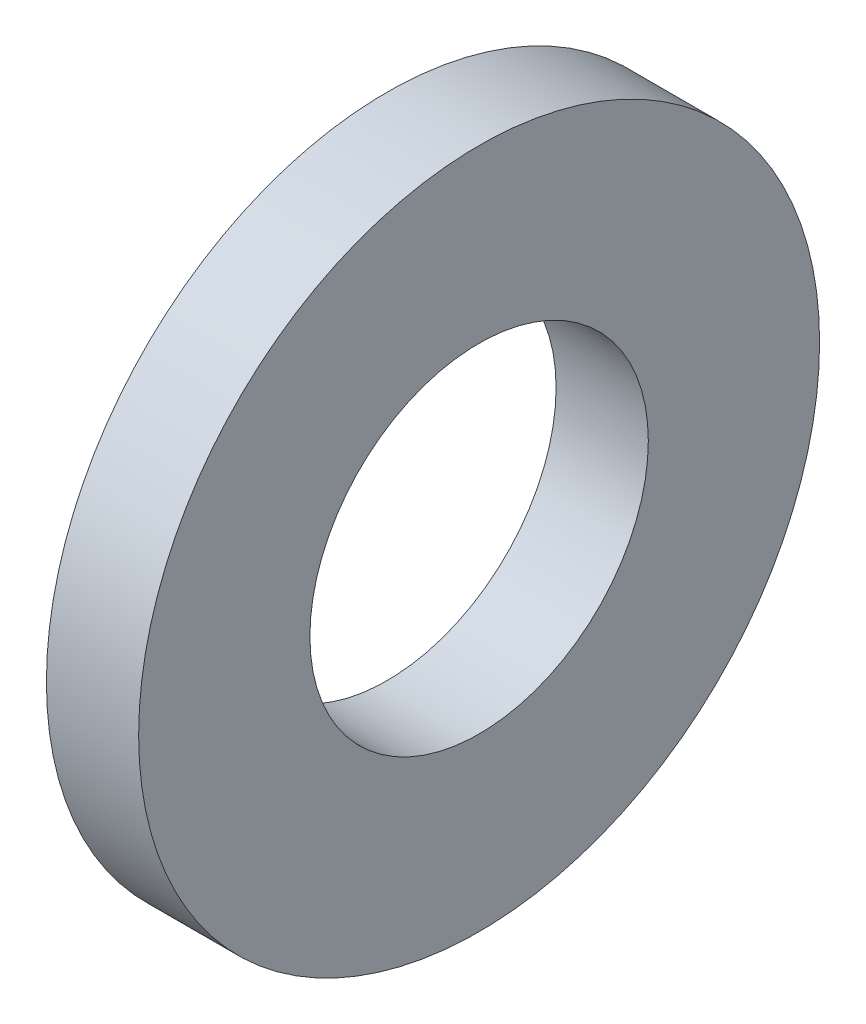
ISO-10303-21;
HEADER;
FILE_DESCRIPTION(('STEP AP214'),'2;1');
FILE_NAME('part.step','',(''),(''),'','','');
FILE_SCHEMA(('AUTOMOTIVE_DESIGN { 1 0 10303 214 1 1 1 1 }'));
ENDSEC;
DATA;
#1=APPLICATION_CONTEXT('core data for automotive mechanical design processes');
#2=APPLICATION_PROTOCOL_DEFINITION('international standard','automotive_design',2000,#1);
#3=PRODUCT_CONTEXT('',#1,'mechanical');
#4=PRODUCT('Part','Part','',(#3));
#5=PRODUCT_RELATED_PRODUCT_CATEGORY('part','',(#4));
#6=PRODUCT_DEFINITION_FORMATION('','',#4);
#7=PRODUCT_DEFINITION_CONTEXT('part definition',#1,'design');
#8=PRODUCT_DEFINITION('design','',#6,#7);
#9=PRODUCT_DEFINITION_SHAPE('','',#8);
#10=(LENGTH_UNIT() NAMED_UNIT(*) SI_UNIT(.MILLI.,.METRE.));
#11=(NAMED_UNIT(*) PLANE_ANGLE_UNIT() SI_UNIT($,.RADIAN.));
#12=(NAMED_UNIT(*) SI_UNIT($,.STERADIAN.) SOLID_ANGLE_UNIT());
#13=UNCERTAINTY_MEASURE_WITH_UNIT(LENGTH_MEASURE(1.E-05),#10,'distance_accuracy_value','');
#14=(GEOMETRIC_REPRESENTATION_CONTEXT(3) GLOBAL_UNCERTAINTY_ASSIGNED_CONTEXT((#13)) GLOBAL_UNIT_ASSIGNED_CONTEXT((#10,
#11,#12)) REPRESENTATION_CONTEXT('',''));
#15=CARTESIAN_POINT('',(0.,0.,0.));
#16=DIRECTION('',(0.,0.,1.));
#17=DIRECTION('',(1.,0.,0.));
#18=AXIS2_PLACEMENT_3D('',#15,#16,#17);
#19=CARTESIAN_POINT('',(2.8448,0.,0.));
#20=DIRECTION('',(1.,0.,0.));
#21=DIRECTION('',(0.,0.,-1.));
#22=AXIS2_PLACEMENT_3D('',#19,#20,#21);
#23=PLANE('',#22);
#24=CARTESIAN_POINT('',(2.8448,0.,0.));
#25=DIRECTION('',(1.,0.,0.));
#26=DIRECTION('',(0.,0.,-1.));
#27=AXIS2_PLACEMENT_3D('',#24,#25,#26);
#28=CIRCLE('',#27,10.5029);
#29=CARTESIAN_POINT('',(2.8448,0.,-10.5029));
#30=VERTEX_POINT('',#29);
#31=EDGE_CURVE('E10',#30,#30,#28,.T.);
#32=ORIENTED_EDGE('',*,*,#31,.T.);
#33=EDGE_LOOP('',(#32));
#34=FACE_BOUND('',#33,.T.);
#35=CARTESIAN_POINT('',(2.8448,0.,0.));
#36=DIRECTION('',(1.,0.,0.));
#37=DIRECTION('',(0.,0.,-1.));
#38=AXIS2_PLACEMENT_3D('',#35,#36,#37);
#39=CIRCLE('',#38,5.2197);
#40=CARTESIAN_POINT('',(2.8448,0.,-5.2197));
#41=VERTEX_POINT('',#40);
#42=EDGE_CURVE('E43',#41,#41,#39,.T.);
#43=ORIENTED_EDGE('',*,*,#42,.F.);
#44=EDGE_LOOP('',(#43));
#45=FACE_BOUND('',#44,.T.);
#46=ADVANCED_FACE('F32',(#34,#45),#23,.T.);
#47=CARTESIAN_POINT('',(0.,0.,0.));
#48=DIRECTION('',(1.,0.,0.));
#49=DIRECTION('',(0.,0.,-1.));
#50=AXIS2_PLACEMENT_3D('',#47,#48,#49);
#51=PLANE('',#50);
#52=CARTESIAN_POINT('',(0.,0.,0.));
#53=DIRECTION('',(1.,0.,0.));
#54=DIRECTION('',(0.,0.,-1.));
#55=AXIS2_PLACEMENT_3D('',#52,#53,#54);
#56=CIRCLE('',#55,10.5029);
#57=CARTESIAN_POINT('',(0.,0.,-10.5029));
#58=VERTEX_POINT('',#57);
#59=EDGE_CURVE('E36',#58,#58,#56,.T.);
#60=ORIENTED_EDGE('',*,*,#59,.F.);
#61=EDGE_LOOP('',(#60));
#62=FACE_BOUND('',#61,.T.);
#63=CARTESIAN_POINT('',(0.,0.,0.));
#64=DIRECTION('',(1.,0.,0.));
#65=DIRECTION('',(0.,0.,-1.));
#66=AXIS2_PLACEMENT_3D('',#63,#64,#65);
#67=CIRCLE('',#66,5.2197);
#68=CARTESIAN_POINT('',(0.,0.,-5.2197));
#69=VERTEX_POINT('',#68);
#70=EDGE_CURVE('E45',#69,#69,#67,.T.);
#71=ORIENTED_EDGE('',*,*,#70,.T.);
#72=EDGE_LOOP('',(#71));
#73=FACE_BOUND('',#72,.T.);
#74=ADVANCED_FACE('F55',(#62,#73),#51,.F.);
#75=CARTESIAN_POINT('',(2.8448,0.,0.));
#76=DIRECTION('',(-1.,0.,0.));
#77=DIRECTION('',(0.,0.,1.));
#78=AXIS2_PLACEMENT_3D('',#75,#76,#77);
#79=CYLINDRICAL_SURFACE('',#78,10.5029);
#80=ORIENTED_EDGE('',*,*,#31,.F.);
#81=EDGE_LOOP('',(#80));
#82=FACE_BOUND('',#81,.T.);
#83=ORIENTED_EDGE('',*,*,#59,.T.);
#84=EDGE_LOOP('',(#83));
#85=FACE_BOUND('',#84,.T.);
#86=ADVANCED_FACE('F34',(#82,#85),#79,.T.);
#87=CARTESIAN_POINT('',(2.8448,0.,0.));
#88=DIRECTION('',(-1.,0.,0.));
#89=DIRECTION('',(0.,0.,1.));
#90=AXIS2_PLACEMENT_3D('',#87,#88,#89);
#91=CYLINDRICAL_SURFACE('',#90,5.2197);
#92=ORIENTED_EDGE('',*,*,#42,.T.);
#93=EDGE_LOOP('',(#92));
#94=FACE_BOUND('',#93,.T.);
#95=ORIENTED_EDGE('',*,*,#70,.F.);
#96=EDGE_LOOP('',(#95));
#97=FACE_BOUND('',#96,.T.);
#98=ADVANCED_FACE('F51',(#94,#97),#91,.F.);
#99=CLOSED_SHELL('',(#46,#74,#86,#98));
#100=MANIFOLD_SOLID_BREP('B2',#99);
#101=ADVANCED_BREP_SHAPE_REPRESENTATION('',(#18,#100),#14);
#102=SHAPE_DEFINITION_REPRESENTATION(#9,#101);
ENDSEC;
END-ISO-10303-21;
